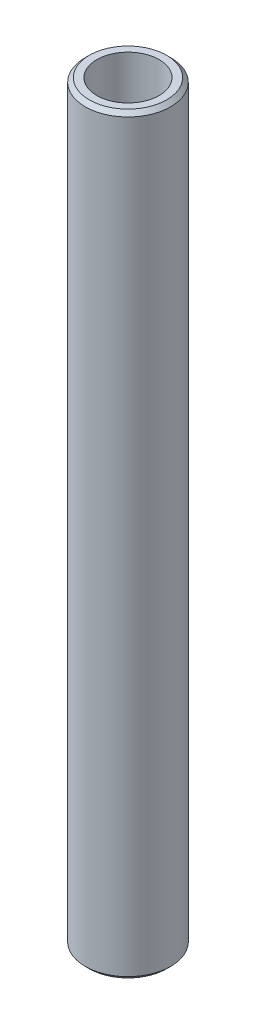
ISO-10303-21;
HEADER;
FILE_DESCRIPTION(('STEP AP214'),'2;1');
FILE_NAME('part.step','',(''),(''),'','','');
FILE_SCHEMA(('AUTOMOTIVE_DESIGN { 1 0 10303 214 1 1 1 1 }'));
ENDSEC;
DATA;
#1=APPLICATION_CONTEXT('core data for automotive mechanical design processes');
#2=APPLICATION_PROTOCOL_DEFINITION('international standard','automotive_design',2000,#1);
#3=PRODUCT_CONTEXT('',#1,'mechanical');
#4=PRODUCT('Part','Part','',(#3));
#5=PRODUCT_RELATED_PRODUCT_CATEGORY('part','',(#4));
#6=PRODUCT_DEFINITION_FORMATION('','',#4);
#7=PRODUCT_DEFINITION_CONTEXT('part definition',#1,'design');
#8=PRODUCT_DEFINITION('design','',#6,#7);
#9=PRODUCT_DEFINITION_SHAPE('','',#8);
#10=(LENGTH_UNIT() NAMED_UNIT(*) SI_UNIT(.MILLI.,.METRE.));
#11=(NAMED_UNIT(*) PLANE_ANGLE_UNIT() SI_UNIT($,.RADIAN.));
#12=(NAMED_UNIT(*) SI_UNIT($,.STERADIAN.) SOLID_ANGLE_UNIT());
#13=UNCERTAINTY_MEASURE_WITH_UNIT(LENGTH_MEASURE(1.E-05),#10,'distance_accuracy_value','');
#14=(GEOMETRIC_REPRESENTATION_CONTEXT(3) GLOBAL_UNCERTAINTY_ASSIGNED_CONTEXT((#13)) GLOBAL_UNIT_ASSIGNED_CONTEXT((#10,
#11,#12)) REPRESENTATION_CONTEXT('',''));
#15=CARTESIAN_POINT('',(0.,0.,0.));
#16=DIRECTION('',(0.,0.,1.));
#17=DIRECTION('',(1.,0.,0.));
#18=AXIS2_PLACEMENT_3D('',#15,#16,#17);
#19=CARTESIAN_POINT('',(0.,308.629632006279,0.));
#20=DIRECTION('',(0.,-1.,0.));
#21=DIRECTION('',(0.,0.,-1.));
#22=AXIS2_PLACEMENT_3D('',#19,#20,#21);
#23=CYLINDRICAL_SURFACE('',#22,17.5);
#24=CARTESIAN_POINT('',(0.,306.988773350063,0.));
#25=DIRECTION('',(0.,1.,0.));
#26=DIRECTION('',(0.,0.,1.));
#27=AXIS2_PLACEMENT_3D('',#24,#25,#26);
#28=CIRCLE('',#27,17.5);
#29=CARTESIAN_POINT('',(0.,306.988773350063,17.5));
#30=VERTEX_POINT('',#29);
#31=EDGE_CURVE('E50',#30,#30,#28,.F.);
#32=ORIENTED_EDGE('',*,*,#31,.T.);
#33=EDGE_LOOP('',(#32));
#34=FACE_BOUND('',#33,.T.);
#35=CARTESIAN_POINT('',(0.,1.6408586562156,0.));
#36=DIRECTION('',(0.,1.,0.));
#37=DIRECTION('',(0.,0.,1.));
#38=AXIS2_PLACEMENT_3D('',#35,#36,#37);
#39=CIRCLE('',#38,17.5);
#40=CARTESIAN_POINT('',(0.,1.6408586562156,17.5));
#41=VERTEX_POINT('',#40);
#42=EDGE_CURVE('E51',#41,#41,#39,.T.);
#43=ORIENTED_EDGE('',*,*,#42,.T.);
#44=EDGE_LOOP('',(#43));
#45=FACE_BOUND('',#44,.T.);
#46=ADVANCED_FACE('F39',(#34,#45),#23,.T.);
#47=CARTESIAN_POINT('',(0.,308.629632006279,0.));
#48=DIRECTION('',(0.,1.,0.));
#49=DIRECTION('',(0.,0.,1.));
#50=AXIS2_PLACEMENT_3D('',#47,#48,#49);
#51=PLANE('',#50);
#52=CARTESIAN_POINT('',(0.,308.629632006279,0.));
#53=DIRECTION('',(0.,1.,0.));
#54=DIRECTION('',(0.,0.,1.));
#55=AXIS2_PLACEMENT_3D('',#52,#53,#54);
#56=CIRCLE('',#55,15.8591413437845);
#57=CARTESIAN_POINT('',(0.,308.629632006279,15.8591413437845));
#58=VERTEX_POINT('',#57);
#59=EDGE_CURVE('E54',#58,#58,#56,.T.);
#60=ORIENTED_EDGE('',*,*,#59,.T.);
#61=EDGE_LOOP('',(#60));
#62=FACE_BOUND('',#61,.T.);
#63=CARTESIAN_POINT('',(0.,308.629632006279,0.));
#64=DIRECTION('',(0.,1.,0.));
#65=DIRECTION('',(0.,0.,1.));
#66=AXIS2_PLACEMENT_3D('',#63,#64,#65);
#67=CIRCLE('',#66,12.7795061772081);
#68=CARTESIAN_POINT('',(0.,308.629632006279,12.7795061772081));
#69=VERTEX_POINT('',#68);
#70=EDGE_CURVE('E58',#69,#69,#67,.T.);
#71=ORIENTED_EDGE('',*,*,#70,.F.);
#72=EDGE_LOOP('',(#71));
#73=FACE_BOUND('',#72,.T.);
#74=ADVANCED_FACE('F69',(#62,#73),#51,.T.);
#75=CARTESIAN_POINT('',(0.,0.,0.));
#76=DIRECTION('',(0.,1.,0.));
#77=DIRECTION('',(0.,0.,1.));
#78=AXIS2_PLACEMENT_3D('',#75,#76,#77);
#79=PLANE('',#78);
#80=CARTESIAN_POINT('',(0.,0.,0.));
#81=DIRECTION('',(0.,1.,0.));
#82=DIRECTION('',(0.,0.,1.));
#83=AXIS2_PLACEMENT_3D('',#80,#81,#82);
#84=CIRCLE('',#83,15.8591413437844);
#85=CARTESIAN_POINT('',(0.,0.,15.8591413437844));
#86=VERTEX_POINT('',#85);
#87=EDGE_CURVE('E10',#86,#86,#84,.F.);
#88=ORIENTED_EDGE('',*,*,#87,.T.);
#89=EDGE_LOOP('',(#88));
#90=FACE_BOUND('',#89,.T.);
#91=CARTESIAN_POINT('',(0.,0.,0.));
#92=DIRECTION('',(0.,1.,0.));
#93=DIRECTION('',(0.,0.,1.));
#94=AXIS2_PLACEMENT_3D('',#91,#92,#93);
#95=CIRCLE('',#94,12.7795061772081);
#96=CARTESIAN_POINT('',(0.,0.,12.7795061772081));
#97=VERTEX_POINT('',#96);
#98=EDGE_CURVE('E63',#97,#97,#95,.T.);
#99=ORIENTED_EDGE('',*,*,#98,.T.);
#100=EDGE_LOOP('',(#99));
#101=FACE_BOUND('',#100,.T.);
#102=ADVANCED_FACE('F75',(#90,#101),#79,.F.);
#103=CARTESIAN_POINT('',(0.,308.629632006279,0.));
#104=DIRECTION('',(0.,-1.,0.));
#105=DIRECTION('',(0.,0.,-1.));
#106=AXIS2_PLACEMENT_3D('',#103,#104,#105);
#107=CYLINDRICAL_SURFACE('',#106,12.7795061772081);
#108=ORIENTED_EDGE('',*,*,#70,.T.);
#109=EDGE_LOOP('',(#108));
#110=FACE_BOUND('',#109,.T.);
#111=ORIENTED_EDGE('',*,*,#98,.F.);
#112=EDGE_LOOP('',(#111));
#113=FACE_BOUND('',#112,.T.);
#114=ADVANCED_FACE('F70',(#110,#113),#107,.F.);
#115=CARTESIAN_POINT('',(0.,308.629632006279,0.));
#116=DIRECTION('',(0.,-1.,0.));
#117=DIRECTION('',(0.,0.,-1.));
#118=AXIS2_PLACEMENT_3D('',#115,#116,#117);
#119=CONICAL_SURFACE('',#118,15.8591413437845,0.785398163397445);
#120=ORIENTED_EDGE('',*,*,#31,.F.);
#121=EDGE_LOOP('',(#120));
#122=FACE_BOUND('',#121,.T.);
#123=ORIENTED_EDGE('',*,*,#59,.F.);
#124=EDGE_LOOP('',(#123));
#125=FACE_BOUND('',#124,.T.);
#126=ADVANCED_FACE('F81',(#122,#125),#119,.T.);
#127=CARTESIAN_POINT('',(0.,1.6408586562156,0.));
#128=DIRECTION('',(0.,1.,0.));
#129=DIRECTION('',(0.,0.,1.));
#130=AXIS2_PLACEMENT_3D('',#127,#128,#129);
#131=CONICAL_SURFACE('',#130,17.5,0.785398163397454);
#132=ORIENTED_EDGE('',*,*,#87,.F.);
#133=EDGE_LOOP('',(#132));
#134=FACE_BOUND('',#133,.T.);
#135=ORIENTED_EDGE('',*,*,#42,.F.);
#136=EDGE_LOOP('',(#135));
#137=FACE_BOUND('',#136,.T.);
#138=ADVANCED_FACE('F45',(#134,#137),#131,.T.);
#139=CLOSED_SHELL('',(#46,#74,#102,#114,#126,#138));
#140=MANIFOLD_SOLID_BREP('B2',#139);
#141=ADVANCED_BREP_SHAPE_REPRESENTATION('',(#18,#140),#14);
#142=SHAPE_DEFINITION_REPRESENTATION(#9,#141);
ENDSEC;
END-ISO-10303-21;
